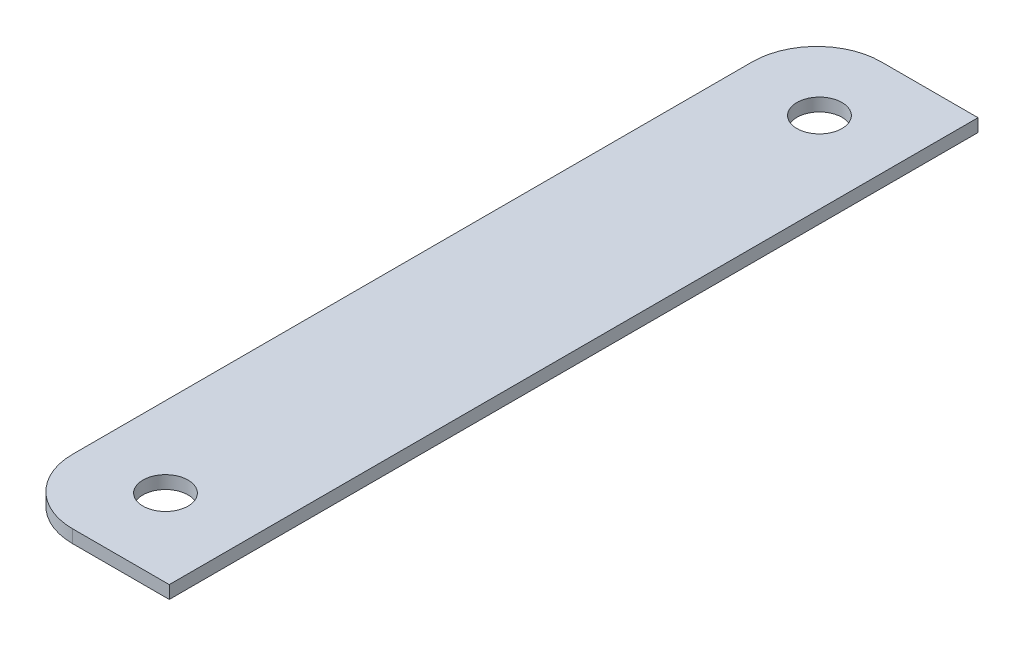
ISO-10303-21;
HEADER;
FILE_DESCRIPTION(('STEP AP214'),'2;1');
FILE_NAME('part.step','',(''),(''),'','','');
FILE_SCHEMA(('AUTOMOTIVE_DESIGN { 1 0 10303 214 1 1 1 1 }'));
ENDSEC;
DATA;
#1=APPLICATION_CONTEXT('core data for automotive mechanical design processes');
#2=APPLICATION_PROTOCOL_DEFINITION('international standard','automotive_design',2000,#1);
#3=PRODUCT_CONTEXT('',#1,'mechanical');
#4=PRODUCT('Part','Part','',(#3));
#5=PRODUCT_RELATED_PRODUCT_CATEGORY('part','',(#4));
#6=PRODUCT_DEFINITION_FORMATION('','',#4);
#7=PRODUCT_DEFINITION_CONTEXT('part definition',#1,'design');
#8=PRODUCT_DEFINITION('design','',#6,#7);
#9=PRODUCT_DEFINITION_SHAPE('','',#8);
#10=(LENGTH_UNIT() NAMED_UNIT(*) SI_UNIT(.MILLI.,.METRE.));
#11=(NAMED_UNIT(*) PLANE_ANGLE_UNIT() SI_UNIT($,.RADIAN.));
#12=(NAMED_UNIT(*) SI_UNIT($,.STERADIAN.) SOLID_ANGLE_UNIT());
#13=UNCERTAINTY_MEASURE_WITH_UNIT(LENGTH_MEASURE(1.E-05),#10,'distance_accuracy_value','');
#14=(GEOMETRIC_REPRESENTATION_CONTEXT(3) GLOBAL_UNCERTAINTY_ASSIGNED_CONTEXT((#13)) GLOBAL_UNIT_ASSIGNED_CONTEXT((#10,
#11,#12)) REPRESENTATION_CONTEXT('',''));
#15=CARTESIAN_POINT('',(0.,0.,0.));
#16=DIRECTION('',(0.,0.,1.));
#17=DIRECTION('',(1.,0.,0.));
#18=AXIS2_PLACEMENT_3D('',#15,#16,#17);
#19=CARTESIAN_POINT('',(110.,-1.99999999999999,197.705554788376));
#20=DIRECTION('',(1.,0.,0.));
#21=DIRECTION('',(0.,0.,-1.00000000000001));
#22=AXIS2_PLACEMENT_3D('',#19,#20,#21);
#23=PLANE('',#22);
#24=DIRECTION('',(0.,1.,0.));
#25=VECTOR('',#24,1.);
#26=CARTESIAN_POINT('',(110.,-2.00000000000017,82.2944452116269));
#27=LINE('',#26,#25);
#28=CARTESIAN_POINT('',(110.,-3.99999999999998,82.2944452116269));
#29=VERTEX_POINT('',#28);
#30=CARTESIAN_POINT('',(110.,-2.00000000000017,82.2944452116269));
#31=VERTEX_POINT('',#30);
#32=EDGE_CURVE('E11',#29,#31,#27,.T.);
#33=ORIENTED_EDGE('',*,*,#32,.F.);
#34=DIRECTION('',(0.,0.,1.));
#35=VECTOR('',#34,1.);
#36=CARTESIAN_POINT('',(110.,-3.99999999999998,1.70974345792469E-13));
#37=LINE('',#36,#35);
#38=CARTESIAN_POINT('',(110.,-3.99999999999998,187.705554788376));
#39=VERTEX_POINT('',#38);
#40=EDGE_CURVE('E100',#39,#29,#37,.F.);
#41=ORIENTED_EDGE('',*,*,#40,.F.);
#42=DIRECTION('',(0.,1.,0.));
#43=VECTOR('',#42,1.);
#44=CARTESIAN_POINT('',(110.,-1.99999999999997,187.705554788376));
#45=LINE('',#44,#43);
#46=CARTESIAN_POINT('',(110.,-1.99999999999997,187.705554788376));
#47=VERTEX_POINT('',#46);
#48=EDGE_CURVE('E47',#39,#47,#45,.T.);
#49=ORIENTED_EDGE('',*,*,#48,.T.);
#50=DIRECTION('',(0.,0.,-1.00000000000001));
#51=VECTOR('',#50,1.);
#52=CARTESIAN_POINT('',(110.,-1.99999999999999,197.705554788376));
#53=LINE('',#52,#51);
#54=EDGE_CURVE('E132',#47,#31,#53,.T.);
#55=ORIENTED_EDGE('',*,*,#54,.T.);
#56=EDGE_LOOP('',(#33,#41,#49,#55));
#57=FACE_BOUND('',#56,.T.);
#58=ADVANCED_FACE('F37',(#57),#23,.F.);
#59=CARTESIAN_POINT('',(120.,-2.00000000000017,187.705554788376));
#60=DIRECTION('',(0.,1.,0.));
#61=DIRECTION('',(-1.,0.,0.));
#62=AXIS2_PLACEMENT_3D('',#59,#60,#61);
#63=CYLINDRICAL_SURFACE('',#62,10.);
#64=ORIENTED_EDGE('',*,*,#48,.F.);
#65=CARTESIAN_POINT('',(120.,-4.00000000000017,187.705554788376));
#66=DIRECTION('',(0.,1.,0.));
#67=DIRECTION('',(-1.,0.,0.));
#68=AXIS2_PLACEMENT_3D('',#65,#66,#67);
#69=CIRCLE('',#68,10.);
#70=CARTESIAN_POINT('',(120.,-3.99999999999998,197.705554788376));
#71=VERTEX_POINT('',#70);
#72=EDGE_CURVE('E115',#39,#71,#69,.T.);
#73=ORIENTED_EDGE('',*,*,#72,.T.);
#74=DIRECTION('',(0.,1.,0.));
#75=VECTOR('',#74,1.);
#76=CARTESIAN_POINT('',(120.,-1.99999999999999,197.705554788376));
#77=LINE('',#76,#75);
#78=CARTESIAN_POINT('',(120.,-1.99999999999999,197.705554788376));
#79=VERTEX_POINT('',#78);
#80=EDGE_CURVE('E125',#71,#79,#77,.T.);
#81=ORIENTED_EDGE('',*,*,#80,.T.);
#82=CARTESIAN_POINT('',(120.,-2.00000000000017,187.705554788376));
#83=DIRECTION('',(0.,1.,0.));
#84=DIRECTION('',(-1.,0.,0.));
#85=AXIS2_PLACEMENT_3D('',#82,#83,#84);
#86=CIRCLE('',#85,10.);
#87=EDGE_CURVE('E141',#47,#79,#86,.T.);
#88=ORIENTED_EDGE('',*,*,#87,.F.);
#89=EDGE_LOOP('',(#64,#73,#81,#88));
#90=FACE_BOUND('',#89,.T.);
#91=ADVANCED_FACE('F144',(#90),#63,.T.);
#92=CARTESIAN_POINT('',(135.,-1.99999999999997,197.705554788376));
#93=DIRECTION('',(0.,0.,-1.));
#94=DIRECTION('',(-1.,0.,0.));
#95=AXIS2_PLACEMENT_3D('',#92,#93,#94);
#96=PLANE('',#95);
#97=ORIENTED_EDGE('',*,*,#80,.F.);
#98=DIRECTION('',(-1.,0.,0.));
#99=VECTOR('',#98,1.);
#100=CARTESIAN_POINT('',(-3.06949217936437E-13,-4.,197.705554788375));
#101=LINE('',#100,#99);
#102=CARTESIAN_POINT('',(135.,-3.99999999999998,197.705554788376));
#103=VERTEX_POINT('',#102);
#104=EDGE_CURVE('E112',#103,#71,#101,.T.);
#105=ORIENTED_EDGE('',*,*,#104,.F.);
#106=DIRECTION('',(0.,1.,0.));
#107=VECTOR('',#106,1.);
#108=CARTESIAN_POINT('',(135.,-1.99999999999997,197.705554788376));
#109=LINE('',#108,#107);
#110=CARTESIAN_POINT('',(135.,-1.99999999999997,197.705554788376));
#111=VERTEX_POINT('',#110);
#112=EDGE_CURVE('E123',#103,#111,#109,.T.);
#113=ORIENTED_EDGE('',*,*,#112,.T.);
#114=DIRECTION('',(-1.,0.,0.));
#115=VECTOR('',#114,1.);
#116=CARTESIAN_POINT('',(135.,-1.99999999999997,197.705554788376));
#117=LINE('',#116,#115);
#118=EDGE_CURVE('E145',#111,#79,#117,.T.);
#119=ORIENTED_EDGE('',*,*,#118,.T.);
#120=EDGE_LOOP('',(#97,#105,#113,#119));
#121=FACE_BOUND('',#120,.T.);
#122=ADVANCED_FACE('F174',(#121),#96,.F.);
#123=CARTESIAN_POINT('',(135.,-1.99999999999997,197.705554788376));
#124=DIRECTION('',(-1.,0.,0.));
#125=DIRECTION('',(0.,0.,1.00000000000001));
#126=AXIS2_PLACEMENT_3D('',#123,#124,#125);
#127=PLANE('',#126);
#128=ORIENTED_EDGE('',*,*,#112,.F.);
#129=DIRECTION('',(0.,0.,1.));
#130=VECTOR('',#129,1.);
#131=CARTESIAN_POINT('',(135.,-3.99999999999998,2.09832151654394E-13));
#132=LINE('',#131,#130);
#133=CARTESIAN_POINT('',(135.,-3.99999999999998,72.2944452116269));
#134=VERTEX_POINT('',#133);
#135=EDGE_CURVE('E109',#134,#103,#132,.T.);
#136=ORIENTED_EDGE('',*,*,#135,.F.);
#137=DIRECTION('',(0.,1.,0.));
#138=VECTOR('',#137,1.);
#139=CARTESIAN_POINT('',(135.,-2.00000000000017,72.2944452116269));
#140=LINE('',#139,#138);
#141=CARTESIAN_POINT('',(135.,-2.00000000000017,72.2944452116269));
#142=VERTEX_POINT('',#141);
#143=EDGE_CURVE('E55',#134,#142,#140,.T.);
#144=ORIENTED_EDGE('',*,*,#143,.T.);
#145=DIRECTION('',(0.,0.,1.00000000000001));
#146=VECTOR('',#145,1.);
#147=CARTESIAN_POINT('',(135.,-1.99999999999997,197.705554788376));
#148=LINE('',#147,#146);
#149=EDGE_CURVE('E147',#142,#111,#148,.T.);
#150=ORIENTED_EDGE('',*,*,#149,.T.);
#151=EDGE_LOOP('',(#128,#136,#144,#150));
#152=FACE_BOUND('',#151,.T.);
#153=ADVANCED_FACE('F186',(#152),#127,.F.);
#154=CARTESIAN_POINT('',(135.,-2.00000000000017,72.2944452116269));
#155=DIRECTION('',(0.,0.,1.));
#156=DIRECTION('',(1.,0.,0.));
#157=AXIS2_PLACEMENT_3D('',#154,#155,#156);
#158=PLANE('',#157);
#159=ORIENTED_EDGE('',*,*,#143,.F.);
#160=DIRECTION('',(-1.,0.,0.));
#161=VECTOR('',#160,1.);
#162=CARTESIAN_POINT('',(-1.12021195981962E-13,-4.,72.2944452116267));
#163=LINE('',#162,#161);
#164=CARTESIAN_POINT('',(119.999999999999,-3.99999999999998,72.2944452116269));
#165=VERTEX_POINT('',#164);
#166=EDGE_CURVE('E98',#165,#134,#163,.F.);
#167=ORIENTED_EDGE('',*,*,#166,.F.);
#168=DIRECTION('',(0.,1.,0.));
#169=VECTOR('',#168,1.);
#170=CARTESIAN_POINT('',(119.999999999999,-1.99999999999997,72.2944452116269));
#171=LINE('',#170,#169);
#172=CARTESIAN_POINT('',(119.999999999999,-1.99999999999997,72.2944452116269));
#173=VERTEX_POINT('',#172);
#174=EDGE_CURVE('E41',#165,#173,#171,.T.);
#175=ORIENTED_EDGE('',*,*,#174,.T.);
#176=DIRECTION('',(1.,0.,0.));
#177=VECTOR('',#176,1.);
#178=CARTESIAN_POINT('',(135.,-2.00000000000017,72.2944452116269));
#179=LINE('',#178,#177);
#180=EDGE_CURVE('E198',#173,#142,#179,.T.);
#181=ORIENTED_EDGE('',*,*,#180,.T.);
#182=EDGE_LOOP('',(#159,#167,#175,#181));
#183=FACE_BOUND('',#182,.T.);
#184=ADVANCED_FACE('F102',(#183),#158,.F.);
#185=CARTESIAN_POINT('',(122.414038057746,-1.99999999999997,185.705554788376));
#186=DIRECTION('',(0.,1.,0.));
#187=DIRECTION('',(-1.,0.,0.));
#188=AXIS2_PLACEMENT_3D('',#185,#186,#187);
#189=CYLINDRICAL_SURFACE('',#188,3.50000000000001);
#190=CARTESIAN_POINT('',(122.414038057746,-1.99999999999997,185.705554788376));
#191=DIRECTION('',(0.,-1.,0.));
#192=DIRECTION('',(1.,0.,0.));
#193=AXIS2_PLACEMENT_3D('',#190,#191,#192);
#194=CIRCLE('',#193,3.50000000000001);
#195=CARTESIAN_POINT('',(125.914038057746,-1.99999999999997,185.705554788376));
#196=VERTEX_POINT('',#195);
#197=EDGE_CURVE('E121',#196,#196,#194,.T.);
#198=ORIENTED_EDGE('',*,*,#197,.F.);
#199=EDGE_LOOP('',(#198));
#200=FACE_BOUND('',#199,.T.);
#201=CARTESIAN_POINT('',(122.414038057746,-3.99999999999997,185.705554788376));
#202=DIRECTION('',(0.,-1.,0.));
#203=DIRECTION('',(1.,0.,0.));
#204=AXIS2_PLACEMENT_3D('',#201,#202,#203);
#205=CIRCLE('',#204,3.50000000000001);
#206=CARTESIAN_POINT('',(125.914038057746,-3.99999999999997,185.705554788376));
#207=VERTEX_POINT('',#206);
#208=EDGE_CURVE('E103',#207,#207,#205,.T.);
#209=ORIENTED_EDGE('',*,*,#208,.T.);
#210=EDGE_LOOP('',(#209));
#211=FACE_BOUND('',#210,.T.);
#212=ADVANCED_FACE('F178',(#200,#211),#189,.F.);
#213=CARTESIAN_POINT('',(120.,-2.00000000000017,82.2944452116268));
#214=DIRECTION('',(0.,1.,0.));
#215=DIRECTION('',(-1.,0.,0.));
#216=AXIS2_PLACEMENT_3D('',#213,#214,#215);
#217=CYLINDRICAL_SURFACE('',#216,10.);
#218=CARTESIAN_POINT('',(120.,-4.00000000000017,82.2944452116268));
#219=DIRECTION('',(0.,1.,0.));
#220=DIRECTION('',(-1.,0.,0.));
#221=AXIS2_PLACEMENT_3D('',#218,#219,#220);
#222=CIRCLE('',#221,10.);
#223=EDGE_CURVE('E86',#165,#29,#222,.T.);
#224=ORIENTED_EDGE('',*,*,#223,.T.);
#225=ORIENTED_EDGE('',*,*,#32,.T.);
#226=CARTESIAN_POINT('',(120.,-2.00000000000017,82.2944452116268));
#227=DIRECTION('',(0.,1.,0.));
#228=DIRECTION('',(-1.,0.,0.));
#229=AXIS2_PLACEMENT_3D('',#226,#227,#228);
#230=CIRCLE('',#229,10.);
#231=EDGE_CURVE('E88',#173,#31,#230,.T.);
#232=ORIENTED_EDGE('',*,*,#231,.F.);
#233=ORIENTED_EDGE('',*,*,#174,.F.);
#234=EDGE_LOOP('',(#224,#225,#232,#233));
#235=FACE_BOUND('',#234,.T.);
#236=ADVANCED_FACE('F85',(#235),#217,.T.);
#237=CARTESIAN_POINT('',(122.414038057746,-1.99999999999997,84.2944452116269));
#238=DIRECTION('',(0.,1.,0.));
#239=DIRECTION('',(-1.,0.,0.));
#240=AXIS2_PLACEMENT_3D('',#237,#238,#239);
#241=CYLINDRICAL_SURFACE('',#240,3.49999999999998);
#242=CARTESIAN_POINT('',(122.414038057746,-1.99999999999997,84.2944452116269));
#243=DIRECTION('',(0.,-1.,0.));
#244=DIRECTION('',(1.,0.,0.));
#245=AXIS2_PLACEMENT_3D('',#242,#243,#244);
#246=CIRCLE('',#245,3.49999999999998);
#247=CARTESIAN_POINT('',(125.914038057746,-1.99999999999997,84.2944452116269));
#248=VERTEX_POINT('',#247);
#249=EDGE_CURVE('E92',#248,#248,#246,.T.);
#250=ORIENTED_EDGE('',*,*,#249,.F.);
#251=EDGE_LOOP('',(#250));
#252=FACE_BOUND('',#251,.T.);
#253=CARTESIAN_POINT('',(122.414038057746,-3.99999999999997,84.2944452116269));
#254=DIRECTION('',(0.,-1.,0.));
#255=DIRECTION('',(1.,0.,0.));
#256=AXIS2_PLACEMENT_3D('',#253,#254,#255);
#257=CIRCLE('',#256,3.49999999999998);
#258=CARTESIAN_POINT('',(125.914038057746,-3.99999999999997,84.2944452116269));
#259=VERTEX_POINT('',#258);
#260=EDGE_CURVE('E111',#259,#259,#257,.T.);
#261=ORIENTED_EDGE('',*,*,#260,.T.);
#262=EDGE_LOOP('',(#261));
#263=FACE_BOUND('',#262,.T.);
#264=ADVANCED_FACE('F39',(#252,#263),#241,.F.);
#265=CARTESIAN_POINT('',(0.,-2.,0.));
#266=DIRECTION('',(0.,1.,0.));
#267=DIRECTION('',(-1.,0.,0.));
#268=AXIS2_PLACEMENT_3D('',#265,#266,#267);
#269=PLANE('',#268);
#270=ORIENTED_EDGE('',*,*,#197,.T.);
#271=EDGE_LOOP('',(#270));
#272=FACE_BOUND('',#271,.T.);
#273=ORIENTED_EDGE('',*,*,#180,.F.);
#274=ORIENTED_EDGE('',*,*,#231,.T.);
#275=ORIENTED_EDGE('',*,*,#54,.F.);
#276=ORIENTED_EDGE('',*,*,#87,.T.);
#277=ORIENTED_EDGE('',*,*,#118,.F.);
#278=ORIENTED_EDGE('',*,*,#149,.F.);
#279=EDGE_LOOP('',(#273,#274,#275,#276,#277,#278));
#280=FACE_BOUND('',#279,.T.);
#281=ORIENTED_EDGE('',*,*,#249,.T.);
#282=EDGE_LOOP('',(#281));
#283=FACE_BOUND('',#282,.T.);
#284=ADVANCED_FACE('F138',(#272,#280,#283),#269,.T.);
#285=CARTESIAN_POINT('',(0.,-4.,0.));
#286=DIRECTION('',(0.,1.,0.));
#287=DIRECTION('',(-1.,0.,0.));
#288=AXIS2_PLACEMENT_3D('',#285,#286,#287);
#289=PLANE('',#288);
#290=ORIENTED_EDGE('',*,*,#208,.F.);
#291=EDGE_LOOP('',(#290));
#292=FACE_BOUND('',#291,.T.);
#293=ORIENTED_EDGE('',*,*,#166,.T.);
#294=ORIENTED_EDGE('',*,*,#135,.T.);
#295=ORIENTED_EDGE('',*,*,#104,.T.);
#296=ORIENTED_EDGE('',*,*,#72,.F.);
#297=ORIENTED_EDGE('',*,*,#40,.T.);
#298=ORIENTED_EDGE('',*,*,#223,.F.);
#299=EDGE_LOOP('',(#293,#294,#295,#296,#297,#298));
#300=FACE_BOUND('',#299,.T.);
#301=ORIENTED_EDGE('',*,*,#260,.F.);
#302=EDGE_LOOP('',(#301));
#303=FACE_BOUND('',#302,.T.);
#304=ADVANCED_FACE('F95',(#292,#300,#303),#289,.F.);
#305=CLOSED_SHELL('',(#58,#91,#122,#153,#184,#212,#236,#264,#284,#304));
#306=MANIFOLD_SOLID_BREP('B2',#305);
#307=ADVANCED_BREP_SHAPE_REPRESENTATION('',(#18,#306),#14);
#308=SHAPE_DEFINITION_REPRESENTATION(#9,#307);
ENDSEC;
END-ISO-10303-21;
